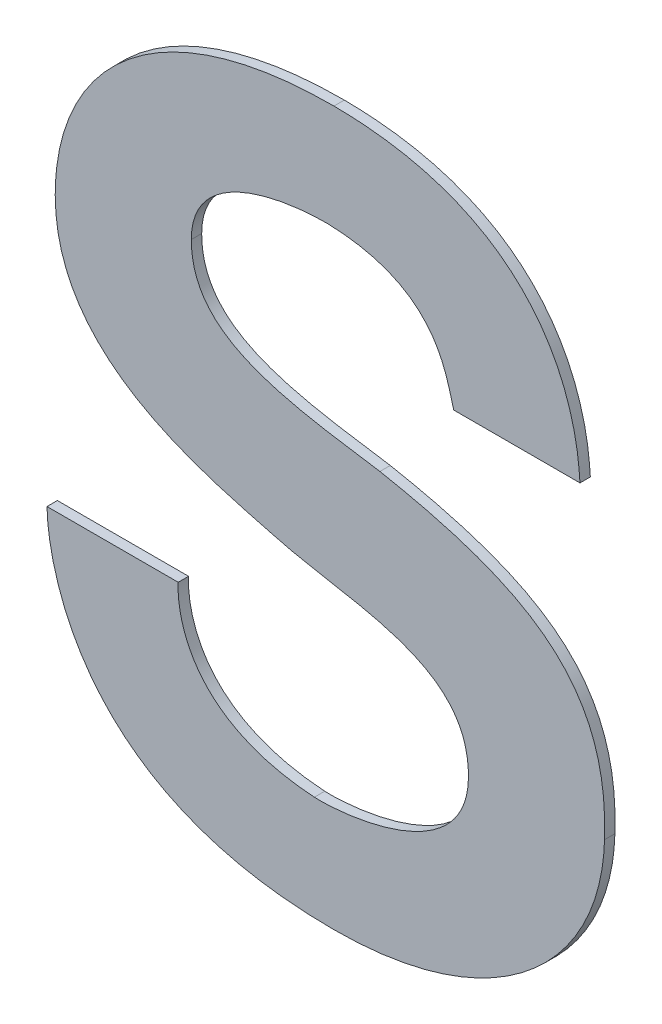
ISO-10303-21;
HEADER;
FILE_DESCRIPTION(('STEP AP214'),'2;1');
FILE_NAME('part.step','',(''),(''),'','','');
FILE_SCHEMA(('AUTOMOTIVE_DESIGN { 1 0 10303 214 1 1 1 1 }'));
ENDSEC;
DATA;
#1=APPLICATION_CONTEXT('core data for automotive mechanical design processes');
#2=APPLICATION_PROTOCOL_DEFINITION('international standard','automotive_design',2000,#1);
#3=PRODUCT_CONTEXT('',#1,'mechanical');
#4=PRODUCT('Part','Part','',(#3));
#5=PRODUCT_RELATED_PRODUCT_CATEGORY('part','',(#4));
#6=PRODUCT_DEFINITION_FORMATION('','',#4);
#7=PRODUCT_DEFINITION_CONTEXT('part definition',#1,'design');
#8=PRODUCT_DEFINITION('design','',#6,#7);
#9=PRODUCT_DEFINITION_SHAPE('','',#8);
#10=(LENGTH_UNIT() NAMED_UNIT(*) SI_UNIT(.MILLI.,.METRE.));
#11=(NAMED_UNIT(*) PLANE_ANGLE_UNIT() SI_UNIT($,.RADIAN.));
#12=(NAMED_UNIT(*) SI_UNIT($,.STERADIAN.) SOLID_ANGLE_UNIT());
#13=UNCERTAINTY_MEASURE_WITH_UNIT(LENGTH_MEASURE(1.E-05),#10,'distance_accuracy_value','');
#14=(GEOMETRIC_REPRESENTATION_CONTEXT(3) GLOBAL_UNCERTAINTY_ASSIGNED_CONTEXT((#13)) GLOBAL_UNIT_ASSIGNED_CONTEXT((#10,
#11,#12)) REPRESENTATION_CONTEXT('',''));
#15=CARTESIAN_POINT('',(0.,0.,0.));
#16=DIRECTION('',(0.,0.,1.));
#17=DIRECTION('',(1.,0.,0.));
#18=AXIS2_PLACEMENT_3D('',#15,#16,#17);
#19=CARTESIAN_POINT('',(3.8557982906351,-0.719548093305039,0.));
#20=CARTESIAN_POINT('',(3.8557982906351,-0.719548093305039,0.003));
#21=CARTESIAN_POINT('',(3.8026562629509,-0.719548093305068,0.));
#22=CARTESIAN_POINT('',(3.8026562629509,-0.719548093305068,0.003));
#23=CARTESIAN_POINT('',(3.7751379758872,-0.748502446570892,0.));
#24=CARTESIAN_POINT('',(3.7751379758872,-0.748502446570892,0.003));
#25=CARTESIAN_POINT('',(3.7751379758872,-0.782186535028101,0.));
#26=CARTESIAN_POINT('',(3.7751379758872,-0.782186535028101,0.003));
#27=B_SPLINE_SURFACE_WITH_KNOTS('',3,1,((#19,#20),(#21,#22),(#23,#24),(#25,#26)),.UNSPECIFIED.,
.F.,.F.,.F.,(4,4),(2,2),(0.,1.),(0.,0.0003),.UNSPECIFIED.);
#28=CARTESIAN_POINT('',(3.8557982906351,-0.719548093305039,0.));
#29=CARTESIAN_POINT('',(3.8026562629509,-0.719548093305068,0.));
#30=CARTESIAN_POINT('',(3.7751379758872,-0.748502446570892,0.));
#31=CARTESIAN_POINT('',(3.7751379758872,-0.782186535028101,0.));
#32=B_SPLINE_CURVE_WITH_KNOTS('',3,(#28,#29,#30,#31),.UNSPECIFIED.,.F.,.F.,(4,4),(0.,1.),.UNSPECIFIED.);
#33=CARTESIAN_POINT('',(3.8557982906351,-0.719548093305039,0.));
#34=VERTEX_POINT('',#33);
#35=CARTESIAN_POINT('',(3.7751379758872,-0.782186535028101,0.));
#36=VERTEX_POINT('',#35);
#37=EDGE_CURVE('E11',#34,#36,#32,.T.);
#38=DIRECTION('',(0.,0.,1.));
#39=VECTOR('',#38,1.);
#40=CARTESIAN_POINT('',(3.7751379758872,-0.782186535028101,0.));
#41=LINE('',#40,#39);
#42=CARTESIAN_POINT('',(3.7751379758872,-0.782186535028101,0.003));
#43=VERTEX_POINT('',#42);
#44=EDGE_CURVE('E28',#36,#43,#41,.T.);
#45=CARTESIAN_POINT('',(3.8557982906351,-0.719548093305039,0.003));
#46=CARTESIAN_POINT('',(3.8026562629509,-0.719548093305068,0.003));
#47=CARTESIAN_POINT('',(3.7751379758872,-0.748502446570892,0.003));
#48=CARTESIAN_POINT('',(3.7751379758872,-0.782186535028101,0.003));
#49=B_SPLINE_CURVE_WITH_KNOTS('',3,(#45,#46,#47,#48),.UNSPECIFIED.,.F.,.F.,(4,4),(0.,1.),.UNSPECIFIED.);
#50=CARTESIAN_POINT('',(3.8557982906351,-0.719548093305039,0.003));
#51=VERTEX_POINT('',#50);
#52=EDGE_CURVE('E140',#51,#43,#49,.T.);
#53=DIRECTION('',(0.,0.,1.));
#54=VECTOR('',#53,1.);
#55=CARTESIAN_POINT('',(3.8557982906351,-0.719548093305039,0.));
#56=LINE('',#55,#54);
#57=EDGE_CURVE('E423',#34,#51,#56,.T.);
#58=ORIENTED_EDGE('',*,*,#37,.T.);
#59=ORIENTED_EDGE('',*,*,#44,.T.);
#60=ORIENTED_EDGE('',*,*,#52,.F.);
#61=ORIENTED_EDGE('',*,*,#57,.F.);
#62=EDGE_LOOP('',(#58,#59,#60,#61));
#63=FACE_BOUND('',#62,.T.);
#64=ADVANCED_FACE('F17',(#63),#27,.T.);
#65=CARTESIAN_POINT('',(3.9269953459074,-0.778401231237702,0.));
#66=CARTESIAN_POINT('',(3.9269953459074,-0.778401231237702,0.003));
#67=CARTESIAN_POINT('',(3.926512271671,-0.775078152073892,0.));
#68=CARTESIAN_POINT('',(3.926512271671,-0.775078152073892,0.003));
#69=CARTESIAN_POINT('',(3.9269953462112,-0.720029263090209,0.));
#70=CARTESIAN_POINT('',(3.9269953462112,-0.720029263090209,0.003));
#71=CARTESIAN_POINT('',(3.8557982906351,-0.719548093305039,0.));
#72=CARTESIAN_POINT('',(3.8557982906351,-0.719548093305039,0.003));
#73=B_SPLINE_SURFACE_WITH_KNOTS('',3,1,((#65,#66),(#67,#68),(#69,#70),(#71,#72)),.UNSPECIFIED.,
.F.,.F.,.F.,(4,4),(2,2),(0.,1.),(0.,0.0003),.UNSPECIFIED.);
#74=CARTESIAN_POINT('',(3.9269953459074,-0.778401231237702,0.));
#75=CARTESIAN_POINT('',(3.926512271671,-0.775078152073892,0.));
#76=CARTESIAN_POINT('',(3.9269953462112,-0.720029263090209,0.));
#77=CARTESIAN_POINT('',(3.8557982906351,-0.719548093305039,0.));
#78=B_SPLINE_CURVE_WITH_KNOTS('',3,(#74,#75,#76,#77),.UNSPECIFIED.,.F.,.F.,(4,4),(0.,1.),.UNSPECIFIED.);
#79=CARTESIAN_POINT('',(3.9269953459074,-0.778401231237702,0.));
#80=VERTEX_POINT('',#79);
#81=EDGE_CURVE('E415',#80,#34,#78,.T.);
#82=CARTESIAN_POINT('',(3.9269953459074,-0.778401231237702,0.003));
#83=CARTESIAN_POINT('',(3.926512271671,-0.775078152073892,0.003));
#84=CARTESIAN_POINT('',(3.9269953462112,-0.720029263090209,0.003));
#85=CARTESIAN_POINT('',(3.8557982906351,-0.719548093305039,0.003));
#86=B_SPLINE_CURVE_WITH_KNOTS('',3,(#82,#83,#84,#85),.UNSPECIFIED.,.F.,.F.,(4,4),(0.,1.),.UNSPECIFIED.);
#87=CARTESIAN_POINT('',(3.9269953459074,-0.778401231237702,0.003));
#88=VERTEX_POINT('',#87);
#89=EDGE_CURVE('E411',#88,#51,#86,.T.);
#90=DIRECTION('',(0.,0.,1.));
#91=VECTOR('',#90,1.);
#92=CARTESIAN_POINT('',(3.9269953459074,-0.778401231237702,0.));
#93=LINE('',#92,#91);
#94=EDGE_CURVE('E408',#80,#88,#93,.T.);
#95=ORIENTED_EDGE('',*,*,#81,.T.);
#96=ORIENTED_EDGE('',*,*,#57,.T.);
#97=ORIENTED_EDGE('',*,*,#89,.F.);
#98=ORIENTED_EDGE('',*,*,#94,.F.);
#99=EDGE_LOOP('',(#95,#96,#97,#98));
#100=FACE_BOUND('',#99,.T.);
#101=ADVANCED_FACE('F491',(#100),#73,.T.);
#102=CARTESIAN_POINT('',(3.8904684905152,-0.778401231237702,0.));
#103=DIRECTION('',(0.,-1.,0.));
#104=DIRECTION('',(1.,0.,0.));
#105=AXIS2_PLACEMENT_3D('',#102,#103,#104);
#106=PLANE('',#105);
#107=DIRECTION('',(1.,0.,0.));
#108=VECTOR('',#107,1.);
#109=CARTESIAN_POINT('',(3.8904684905152,-0.778401231237702,0.));
#110=LINE('',#109,#108);
#111=CARTESIAN_POINT('',(3.8904684905152,-0.778401231237702,0.));
#112=VERTEX_POINT('',#111);
#113=EDGE_CURVE('E405',#112,#80,#110,.T.);
#114=ORIENTED_EDGE('',*,*,#113,.T.);
#115=ORIENTED_EDGE('',*,*,#94,.T.);
#116=DIRECTION('',(1.,0.,0.));
#117=VECTOR('',#116,1.);
#118=CARTESIAN_POINT('',(3.8904684905152,-0.778401231237702,0.003));
#119=LINE('',#118,#117);
#120=CARTESIAN_POINT('',(3.8904684905152,-0.778401231237702,0.003));
#121=VERTEX_POINT('',#120);
#122=EDGE_CURVE('E402',#121,#88,#119,.T.);
#123=ORIENTED_EDGE('',*,*,#122,.F.);
#124=DIRECTION('',(0.,0.,1.));
#125=VECTOR('',#124,1.);
#126=CARTESIAN_POINT('',(3.8904684905152,-0.778401231237702,0.));
#127=LINE('',#126,#125);
#128=EDGE_CURVE('E396',#112,#121,#127,.T.);
#129=ORIENTED_EDGE('',*,*,#128,.F.);
#130=EDGE_LOOP('',(#114,#115,#123,#129));
#131=FACE_BOUND('',#130,.T.);
#132=ADVANCED_FACE('F488',(#131),#106,.T.);
#133=CARTESIAN_POINT('',(3.8539226896577,-0.749927145494897,0.));
#134=CARTESIAN_POINT('',(3.8539226896577,-0.749927145494897,0.003));
#135=CARTESIAN_POINT('',(3.8857036783637,-0.750867792622892,0.));
#136=CARTESIAN_POINT('',(3.8857036783637,-0.750867792622892,0.003));
#137=CARTESIAN_POINT('',(3.8880624083526,-0.770312467639434,0.));
#138=CARTESIAN_POINT('',(3.8880624083526,-0.770312467639434,0.003));
#139=CARTESIAN_POINT('',(3.8904684905152,-0.778401231237702,0.));
#140=CARTESIAN_POINT('',(3.8904684905152,-0.778401231237702,0.003));
#141=B_SPLINE_SURFACE_WITH_KNOTS('',3,1,((#133,#134),(#135,#136),(#137,#138),(#139,#140)),
.UNSPECIFIED.,.F.,.F.,.F.,(4,4),(2,2),(0.,1.),(0.,0.0003),.UNSPECIFIED.);
#142=CARTESIAN_POINT('',(3.8539226896577,-0.749927145494897,0.));
#143=CARTESIAN_POINT('',(3.8857036783637,-0.750867792622892,0.));
#144=CARTESIAN_POINT('',(3.8880624083526,-0.770312467639434,0.));
#145=CARTESIAN_POINT('',(3.8904684905152,-0.778401231237702,0.));
#146=B_SPLINE_CURVE_WITH_KNOTS('',3,(#142,#143,#144,#145),.UNSPECIFIED.,.F.,.F.,(4,4),(0.,1.),.UNSPECIFIED.);
#147=CARTESIAN_POINT('',(3.8539226896577,-0.749927145494897,0.));
#148=VERTEX_POINT('',#147);
#149=EDGE_CURVE('E388',#148,#112,#146,.T.);
#150=CARTESIAN_POINT('',(3.8539226896577,-0.749927145494897,0.003));
#151=CARTESIAN_POINT('',(3.8857036783637,-0.750867792622892,0.003));
#152=CARTESIAN_POINT('',(3.8880624083526,-0.770312467639434,0.003));
#153=CARTESIAN_POINT('',(3.8904684905152,-0.778401231237702,0.003));
#154=B_SPLINE_CURVE_WITH_KNOTS('',3,(#150,#151,#152,#153),.UNSPECIFIED.,.F.,.F.,(4,4),(0.,1.),.UNSPECIFIED.);
#155=CARTESIAN_POINT('',(3.8539226896577,-0.749927145494897,0.003));
#156=VERTEX_POINT('',#155);
#157=EDGE_CURVE('E383',#156,#121,#154,.T.);
#158=DIRECTION('',(0.,0.,1.));
#159=VECTOR('',#158,1.);
#160=CARTESIAN_POINT('',(3.8539226896577,-0.749927145494897,0.));
#161=LINE('',#160,#159);
#162=EDGE_CURVE('E377',#148,#156,#161,.T.);
#163=ORIENTED_EDGE('',*,*,#149,.T.);
#164=ORIENTED_EDGE('',*,*,#128,.T.);
#165=ORIENTED_EDGE('',*,*,#157,.F.);
#166=ORIENTED_EDGE('',*,*,#162,.F.);
#167=EDGE_LOOP('',(#163,#164,#165,#166));
#168=FACE_BOUND('',#167,.T.);
#169=ADVANCED_FACE('F485',(#168),#141,.T.);
#170=CARTESIAN_POINT('',(3.8145255964063,-0.773635499663952,0.));
#171=CARTESIAN_POINT('',(3.8145255964063,-0.773635499663952,0.003));
#172=CARTESIAN_POINT('',(3.814525597177,-0.755152310392204,0.));
#173=CARTESIAN_POINT('',(3.814525597177,-0.755152310392204,0.003));
#174=CARTESIAN_POINT('',(3.838264263319,-0.74992714780477,0.));
#175=CARTESIAN_POINT('',(3.838264263319,-0.74992714780477,0.003));
#176=CARTESIAN_POINT('',(3.8539226896577,-0.749927145494897,0.));
#177=CARTESIAN_POINT('',(3.8539226896577,-0.749927145494897,0.003));
#178=B_SPLINE_SURFACE_WITH_KNOTS('',3,1,((#170,#171),(#172,#173),(#174,#175),(#176,#177)),
.UNSPECIFIED.,.F.,.F.,.F.,(4,4),(2,2),(0.,1.),(0.,0.0003),.UNSPECIFIED.);
#179=CARTESIAN_POINT('',(3.8145255964063,-0.773635499663952,0.));
#180=CARTESIAN_POINT('',(3.814525597177,-0.755152310392204,0.));
#181=CARTESIAN_POINT('',(3.838264263319,-0.74992714780477,0.));
#182=CARTESIAN_POINT('',(3.8539226896577,-0.749927145494897,0.));
#183=B_SPLINE_CURVE_WITH_KNOTS('',3,(#179,#180,#181,#182),.UNSPECIFIED.,.F.,.F.,(4,4),(0.,1.),.UNSPECIFIED.);
#184=CARTESIAN_POINT('',(3.8145255964063,-0.773635499663952,0.));
#185=VERTEX_POINT('',#184);
#186=EDGE_CURVE('E369',#185,#148,#183,.T.);
#187=CARTESIAN_POINT('',(3.8145255964063,-0.773635499663952,0.003));
#188=CARTESIAN_POINT('',(3.814525597177,-0.755152310392204,0.003));
#189=CARTESIAN_POINT('',(3.838264263319,-0.74992714780477,0.003));
#190=CARTESIAN_POINT('',(3.8539226896577,-0.749927145494897,0.003));
#191=B_SPLINE_CURVE_WITH_KNOTS('',3,(#187,#188,#189,#190),.UNSPECIFIED.,.F.,.F.,(4,4),(0.,1.),.UNSPECIFIED.);
#192=CARTESIAN_POINT('',(3.8145255964063,-0.773635499663952,0.003));
#193=VERTEX_POINT('',#192);
#194=EDGE_CURVE('E364',#193,#156,#191,.T.);
#195=DIRECTION('',(0.,0.,1.));
#196=VECTOR('',#195,1.);
#197=CARTESIAN_POINT('',(3.8145255964063,-0.773635499663952,0.));
#198=LINE('',#197,#196);
#199=EDGE_CURVE('E358',#185,#193,#198,.T.);
#200=ORIENTED_EDGE('',*,*,#186,.T.);
#201=ORIENTED_EDGE('',*,*,#162,.T.);
#202=ORIENTED_EDGE('',*,*,#194,.F.);
#203=ORIENTED_EDGE('',*,*,#199,.F.);
#204=EDGE_LOOP('',(#200,#201,#202,#203));
#205=FACE_BOUND('',#204,.T.);
#206=ADVANCED_FACE('F482',(#205),#178,.T.);
#207=CARTESIAN_POINT('',(3.8690980066546,-0.804473032093063,0.));
#208=CARTESIAN_POINT('',(3.8690980066546,-0.804473032093063,0.003));
#209=CARTESIAN_POINT('',(3.8410871419968,-0.800210298121506,0.));
#210=CARTESIAN_POINT('',(3.8410871419968,-0.800210298121506,0.003));
#211=CARTESIAN_POINT('',(3.8145256003293,-0.796906213605293,0.));
#212=CARTESIAN_POINT('',(3.8145256003293,-0.796906213605293,0.003));
#213=CARTESIAN_POINT('',(3.8145255964063,-0.773635499663952,0.));
#214=CARTESIAN_POINT('',(3.8145255964063,-0.773635499663952,0.003));
#215=B_SPLINE_SURFACE_WITH_KNOTS('',3,1,((#207,#208),(#209,#210),(#211,#212),(#213,#214)),
.UNSPECIFIED.,.F.,.F.,.F.,(4,4),(2,2),(0.,1.),(0.,0.0003),.UNSPECIFIED.);
#216=CARTESIAN_POINT('',(3.8690980066546,-0.804473032093063,0.));
#217=CARTESIAN_POINT('',(3.8410871419968,-0.800210298121506,0.));
#218=CARTESIAN_POINT('',(3.8145256003293,-0.796906213605293,0.));
#219=CARTESIAN_POINT('',(3.8145255964063,-0.773635499663952,0.));
#220=B_SPLINE_CURVE_WITH_KNOTS('',3,(#216,#217,#218,#219),.UNSPECIFIED.,.F.,.F.,(4,4),(0.,1.),.UNSPECIFIED.);
#221=CARTESIAN_POINT('',(3.8690980066546,-0.804473032093063,0.));
#222=VERTEX_POINT('',#221);
#223=EDGE_CURVE('E350',#222,#185,#220,.T.);
#224=CARTESIAN_POINT('',(3.8690980066546,-0.804473032093063,0.003));
#225=CARTESIAN_POINT('',(3.8410871419968,-0.800210298121506,0.003));
#226=CARTESIAN_POINT('',(3.8145256003293,-0.796906213605293,0.003));
#227=CARTESIAN_POINT('',(3.8145255964063,-0.773635499663952,0.003));
#228=B_SPLINE_CURVE_WITH_KNOTS('',3,(#224,#225,#226,#227),.UNSPECIFIED.,.F.,.F.,(4,4),(0.,1.),.UNSPECIFIED.);
#229=CARTESIAN_POINT('',(3.8690980066546,-0.804473032093063,0.003));
#230=VERTEX_POINT('',#229);
#231=EDGE_CURVE('E345',#230,#193,#228,.T.);
#232=DIRECTION('',(0.,0.,1.));
#233=VECTOR('',#232,1.);
#234=CARTESIAN_POINT('',(3.8690980066546,-0.804473032093063,0.));
#235=LINE('',#234,#233);
#236=EDGE_CURVE('E339',#222,#230,#235,.T.);
#237=ORIENTED_EDGE('',*,*,#223,.T.);
#238=ORIENTED_EDGE('',*,*,#199,.T.);
#239=ORIENTED_EDGE('',*,*,#231,.F.);
#240=ORIENTED_EDGE('',*,*,#236,.F.);
#241=EDGE_LOOP('',(#237,#238,#239,#240));
#242=FACE_BOUND('',#241,.T.);
#243=ADVANCED_FACE('F479',(#242),#215,.T.);
#244=CARTESIAN_POINT('',(3.9340998950631,-0.864269654153528,0.));
#245=CARTESIAN_POINT('',(3.9340998950631,-0.864269654153528,0.003));
#246=CARTESIAN_POINT('',(3.9355397503589,-0.825384088440838,0.));
#247=CARTESIAN_POINT('',(3.9355397503589,-0.825384088440838,0.003));
#248=CARTESIAN_POINT('',(3.9113369195682,-0.812565587217635,0.));
#249=CARTESIAN_POINT('',(3.9113369195682,-0.812565587217635,0.003));
#250=CARTESIAN_POINT('',(3.8690980066546,-0.804473032093063,0.));
#251=CARTESIAN_POINT('',(3.8690980066546,-0.804473032093063,0.003));
#252=B_SPLINE_SURFACE_WITH_KNOTS('',3,1,((#244,#245),(#246,#247),(#248,#249),(#250,#251)),
.UNSPECIFIED.,.F.,.F.,.F.,(4,4),(2,2),(0.,1.),(0.,0.0003),.UNSPECIFIED.);
#253=CARTESIAN_POINT('',(3.9340998950631,-0.864269654153528,0.));
#254=CARTESIAN_POINT('',(3.9355397503589,-0.825384088440838,0.));
#255=CARTESIAN_POINT('',(3.9113369195682,-0.812565587217635,0.));
#256=CARTESIAN_POINT('',(3.8690980066546,-0.804473032093063,0.));
#257=B_SPLINE_CURVE_WITH_KNOTS('',3,(#253,#254,#255,#256),.UNSPECIFIED.,.F.,.F.,(4,4),(0.,1.),.UNSPECIFIED.);
#258=CARTESIAN_POINT('',(3.9340998950631,-0.864269654153528,0.));
#259=VERTEX_POINT('',#258);
#260=EDGE_CURVE('E331',#259,#222,#257,.T.);
#261=CARTESIAN_POINT('',(3.9340998950631,-0.864269654153528,0.003));
#262=CARTESIAN_POINT('',(3.9355397503589,-0.825384088440838,0.003));
#263=CARTESIAN_POINT('',(3.9113369195682,-0.812565587217635,0.003));
#264=CARTESIAN_POINT('',(3.8690980066546,-0.804473032093063,0.003));
#265=B_SPLINE_CURVE_WITH_KNOTS('',3,(#261,#262,#263,#264),.UNSPECIFIED.,.F.,.F.,(4,4),(0.,1.),.UNSPECIFIED.);
#266=CARTESIAN_POINT('',(3.9340998950631,-0.864269654153528,0.003));
#267=VERTEX_POINT('',#266);
#268=EDGE_CURVE('E326',#267,#230,#265,.T.);
#269=DIRECTION('',(0.,0.,1.));
#270=VECTOR('',#269,1.);
#271=CARTESIAN_POINT('',(3.9340998950631,-0.864269654153528,0.));
#272=LINE('',#271,#270);
#273=EDGE_CURVE('E323',#259,#267,#272,.T.);
#274=ORIENTED_EDGE('',*,*,#260,.T.);
#275=ORIENTED_EDGE('',*,*,#236,.T.);
#276=ORIENTED_EDGE('',*,*,#268,.F.);
#277=ORIENTED_EDGE('',*,*,#273,.F.);
#278=EDGE_LOOP('',(#274,#275,#276,#277));
#279=FACE_BOUND('',#278,.T.);
#280=ADVANCED_FACE('F476',(#279),#252,.T.);
#281=CARTESIAN_POINT('',(3.8557982906351,-0.925968400841521,0.));
#282=CARTESIAN_POINT('',(3.8557982906351,-0.925968400841521,0.003));
#283=CARTESIAN_POINT('',(3.9027830984676,-0.925968429307479,0.));
#284=CARTESIAN_POINT('',(3.9027830984676,-0.925968429307479,0.003));
#285=CARTESIAN_POINT('',(3.9331621256302,-0.89843495825902,0.));
#286=CARTESIAN_POINT('',(3.9331621256302,-0.89843495825902,0.003));
#287=CARTESIAN_POINT('',(3.9340998950631,-0.864269654153528,0.));
#288=CARTESIAN_POINT('',(3.9340998950631,-0.864269654153528,0.003));
#289=B_SPLINE_SURFACE_WITH_KNOTS('',3,1,((#281,#282),(#283,#284),(#285,#286),(#287,#288)),
.UNSPECIFIED.,.F.,.F.,.F.,(4,4),(2,2),(0.,1.),(0.,0.0003),.UNSPECIFIED.);
#290=CARTESIAN_POINT('',(3.8557982906351,-0.925968400841521,0.));
#291=CARTESIAN_POINT('',(3.9027830984676,-0.925968429307479,0.));
#292=CARTESIAN_POINT('',(3.9331621256302,-0.89843495825902,0.));
#293=CARTESIAN_POINT('',(3.9340998950631,-0.864269654153528,0.));
#294=B_SPLINE_CURVE_WITH_KNOTS('',3,(#290,#291,#292,#293),.UNSPECIFIED.,.F.,.F.,(4,4),(0.,1.),.UNSPECIFIED.);
#295=CARTESIAN_POINT('',(3.8557982906351,-0.925968400841521,0.));
#296=VERTEX_POINT('',#295);
#297=EDGE_CURVE('E313',#296,#259,#294,.T.);
#298=CARTESIAN_POINT('',(3.8557982906351,-0.925968400841521,0.003));
#299=CARTESIAN_POINT('',(3.9027830984676,-0.925968429307479,0.003));
#300=CARTESIAN_POINT('',(3.9331621256302,-0.89843495825902,0.003));
#301=CARTESIAN_POINT('',(3.9340998950631,-0.864269654153528,0.003));
#302=B_SPLINE_CURVE_WITH_KNOTS('',3,(#298,#299,#300,#301),.UNSPECIFIED.,.F.,.F.,(4,4),(0.,1.),.UNSPECIFIED.);
#303=CARTESIAN_POINT('',(3.8557982906351,-0.925968400841521,0.003));
#304=VERTEX_POINT('',#303);
#305=EDGE_CURVE('E303',#304,#267,#302,.T.);
#306=DIRECTION('',(0.,0.,1.));
#307=VECTOR('',#306,1.);
#308=CARTESIAN_POINT('',(3.8557982906351,-0.925968400841521,0.));
#309=LINE('',#308,#307);
#310=EDGE_CURVE('E301',#296,#304,#309,.T.);
#311=ORIENTED_EDGE('',*,*,#297,.T.);
#312=ORIENTED_EDGE('',*,*,#273,.T.);
#313=ORIENTED_EDGE('',*,*,#305,.F.);
#314=ORIENTED_EDGE('',*,*,#310,.F.);
#315=EDGE_LOOP('',(#311,#312,#313,#314));
#316=FACE_BOUND('',#315,.T.);
#317=ADVANCED_FACE('F272',(#316),#289,.T.);
#318=CARTESIAN_POINT('',(3.7727603201028,-0.861427834491345,0.));
#319=CARTESIAN_POINT('',(3.7727603201028,-0.861427834491345,0.003));
#320=CARTESIAN_POINT('',(3.7727598352929,-0.861454182853754,0.));
#321=CARTESIAN_POINT('',(3.7727598352929,-0.861454182853754,0.003));
#322=CARTESIAN_POINT('',(3.7718130468821,-0.925968530995148,0.));
#323=CARTESIAN_POINT('',(3.7718130468821,-0.925968530995148,0.003));
#324=CARTESIAN_POINT('',(3.8557982906351,-0.925968400841521,0.));
#325=CARTESIAN_POINT('',(3.8557982906351,-0.925968400841521,0.003));
#326=B_SPLINE_SURFACE_WITH_KNOTS('',3,1,((#318,#319),(#320,#321),(#322,#323),(#324,#325)),
.UNSPECIFIED.,.F.,.F.,.F.,(4,4),(2,2),(0.,1.),(0.,0.0003),.UNSPECIFIED.);
#327=CARTESIAN_POINT('',(3.7727603201028,-0.861427834491345,0.));
#328=CARTESIAN_POINT('',(3.7727598352929,-0.861454182853754,0.));
#329=CARTESIAN_POINT('',(3.7718130468821,-0.925968530995148,0.));
#330=CARTESIAN_POINT('',(3.8557982906351,-0.925968400841521,0.));
#331=B_SPLINE_CURVE_WITH_KNOTS('',3,(#327,#328,#329,#330),.UNSPECIFIED.,.F.,.F.,(4,4),(0.,1.),.UNSPECIFIED.);
#332=CARTESIAN_POINT('',(3.7727603201028,-0.861427834491345,0.));
#333=VERTEX_POINT('',#332);
#334=EDGE_CURVE('E298',#333,#296,#331,.T.);
#335=CARTESIAN_POINT('',(3.8557982906351,-0.925968400841521,0.003));
#336=CARTESIAN_POINT('',(3.85325423236502,-0.925968022084498,0.003));
#337=CARTESIAN_POINT('',(3.85070933367878,-0.925909183452784,0.003));
#338=CARTESIAN_POINT('',(3.84578095483742,-0.925664864982023,0.003));
#339=CARTESIAN_POINT('',(3.84339707058699,-0.925487304762054,0.003));
#340=CARTESIAN_POINT('',(3.83878515445427,-0.925013968522742,0.003));
#341=CARTESIAN_POINT('',(3.8365563588247,-0.924725930462439,0.003));
#342=CARTESIAN_POINT('',(3.83327867944572,-0.924203545866295,0.003));
#343=CARTESIAN_POINT('',(3.83222159154248,-0.924019743962702,0.003));
#344=CARTESIAN_POINT('',(3.83014446561794,-0.923626573497493,0.003));
#345=CARTESIAN_POINT('',(3.82912425554253,-0.923418120522816,0.003));
#346=CARTESIAN_POINT('',(3.82712028793692,-0.922976661732953,0.003));
#347=CARTESIAN_POINT('',(3.82613633414177,-0.922744547852797,0.003));
#348=CARTESIAN_POINT('',(3.82420423779819,-0.922256776248891,0.003));
#349=CARTESIAN_POINT('',(3.8232558771957,-0.922001984093891,0.003));
#350=CARTESIAN_POINT('',(3.821394335632,-0.921469869927963,0.003));
#351=CARTESIAN_POINT('',(3.82048091598287,-0.921193384271723,0.003));
#352=CARTESIAN_POINT('',(3.81868862031097,-0.92061889936277,0.003));
#353=CARTESIAN_POINT('',(3.81780948677202,-0.920321704689423,0.003));
#354=CARTESIAN_POINT('',(3.81608512617349,-0.919706820684976,0.003));
#355=CARTESIAN_POINT('',(3.81523962471023,-0.919389901856867,0.003));
#356=CARTESIAN_POINT('',(3.81358188884251,-0.918736590684973,0.003));
#357=CARTESIAN_POINT('',(3.81276936530744,-0.918400932808981,0.003));
#358=CARTESIAN_POINT('',(3.81117694364445,-0.917711166561225,0.003));
#359=CARTESIAN_POINT('',(3.81039674396017,-0.917357755051958,0.003));
#360=CARTESIAN_POINT('',(3.80886832591788,-0.916633506004873,0.003));
#361=CARTESIAN_POINT('',(3.80811979597063,-0.916263326586144,0.003));
#362=CARTESIAN_POINT('',(3.80665407083026,-0.915506567178773,0.003));
#363=CARTESIAN_POINT('',(3.80593655643477,-0.915120605887991,0.003));
#364=CARTESIAN_POINT('',(3.80453221331935,-0.914333308702355,0.003));
#365=CARTESIAN_POINT('',(3.80384506016524,-0.913932551880109,0.003));
#366=CARTESIAN_POINT('',(3.802500788006,-0.91311668961301,0.003));
#367=CARTESIAN_POINT('',(3.80184334161206,-0.912702123882166,0.003));
#368=CARTESIAN_POINT('',(3.80055782912301,-0.911859669312288,0.003));
#369=CARTESIAN_POINT('',(3.79992943479589,-0.911432281546223,0.003));
#370=CARTESIAN_POINT('',(3.79870137045368,-0.91056520749699,0.003));
#371=CARTESIAN_POINT('',(3.79810137325478,-0.910125984778709,0.003));
#372=CARTESIAN_POINT('',(3.79692944528614,-0.909236264078797,0.003));
#373=CARTESIAN_POINT('',(3.79635719000817,-0.908786193653105,0.003));
#374=CARTESIAN_POINT('',(3.79524008638514,-0.907875799095952,0.003));
#375=CARTESIAN_POINT('',(3.7946949175392,-0.907415868316767,0.003));
#376=CARTESIAN_POINT('',(3.79363132598296,-0.906486772622364,0.003));
#377=CARTESIAN_POINT('',(3.7931125877976,-0.906017968899881,0.003));
#378=CARTESIAN_POINT('',(3.79210119578812,-0.905072144675416,0.003));
#379=CARTESIAN_POINT('',(3.79160823221629,-0.904595455418975,0.003));
#380=CARTESIAN_POINT('',(3.79064772701628,-0.903634875138655,0.003));
#381=CARTESIAN_POINT('',(3.79017988176161,-0.903151287722976,0.003));
#382=CARTESIAN_POINT('',(3.78926895041985,-0.902177923660029,0.003));
#383=CARTESIAN_POINT('',(3.78882556693571,-0.901688425325827,0.003));
#384=CARTESIAN_POINT('',(3.78796289639052,-0.900704249684828,0.003));
#385=CARTESIAN_POINT('',(3.7875433180128,-0.90020982770584,0.003));
#386=CARTESIAN_POINT('',(3.78672759485095,-0.899216812057981,0.003));
#387=CARTESIAN_POINT('',(3.78633116447028,-0.898718452975431,0.003));
#388=CARTESIAN_POINT('',(3.78556107594867,-0.897718570256162,0.003));
#389=CARTESIAN_POINT('',(3.78518713737083,-0.897217262538499,0.003));
#390=CARTESIAN_POINT('',(3.78446136785628,-0.896212479769446,0.003));
#391=CARTESIAN_POINT('',(3.78410926103595,-0.895709204069347,0.003));
#392=CARTESIAN_POINT('',(3.78342650508581,-0.894701508800733,0.003));
#393=CARTESIAN_POINT('',(3.78309558361063,-0.894197273299538,0.003));
#394=CARTESIAN_POINT('',(3.78214288560281,-0.892698279604937,0.003));
#395=CARTESIAN_POINT('',(3.78154177409275,-0.891690275004185,0.003));
#396=CARTESIAN_POINT('',(3.78041861133561,-0.889681116655772,0.003));
#397=CARTESIAN_POINT('',(3.77989442758137,-0.888681150267366,0.003));
#398=CARTESIAN_POINT('',(3.77891977802082,-0.886696026178137,0.003));
#399=CARTESIAN_POINT('',(3.77846718471204,-0.885711912564393,0.003));
#400=CARTESIAN_POINT('',(3.77763047336567,-0.883766521345258,0.003));
#401=CARTESIAN_POINT('',(3.7772442092494,-0.882806165311103,0.003));
#402=CARTESIAN_POINT('',(3.77653491593099,-0.880916268806863,0.003));
#403=CARTESIAN_POINT('',(3.7762097072517,-0.879987545316753,0.003));
#404=CARTESIAN_POINT('',(3.77561730545157,-0.878168885457548,0.003));
#405=CARTESIAN_POINT('',(3.77534788900867,-0.877279672414474,0.003));
#406=CARTESIAN_POINT('',(3.7748618591584,-0.875547994111038,0.003));
#407=CARTESIAN_POINT('',(3.77464297351438,-0.874706165998672,0.003));
#408=CARTESIAN_POINT('',(3.77425280561909,-0.873077213485238,0.003));
#409=CARTESIAN_POINT('',(3.77407920061869,-0.87229064497237,0.003));
#410=CARTESIAN_POINT('',(3.77377437094233,-0.870780162473227,0.003));
#411=CARTESIAN_POINT('',(3.77364077720243,-0.870056726844835,0.003));
#412=CARTESIAN_POINT('',(3.7734108251195,-0.868680463701601,0.003));
#413=CARTESIAN_POINT('',(3.77331204870374,-0.868028039471472,0.003));
#414=CARTESIAN_POINT('',(3.77314632524421,-0.866801734651693,0.003));
#415=CARTESIAN_POINT('',(3.77307694661686,-0.866228186794536,0.003));
#416=CARTESIAN_POINT('',(3.77296539780327,-0.865167618557124,0.003));
#417=CARTESIAN_POINT('',(3.77292068412931,-0.864680856316672,0.003));
#418=CARTESIAN_POINT('',(3.77282875756775,-0.863512743449046,0.003));
#419=CARTESIAN_POINT('',(3.77278759377169,-0.862830824473404,0.003));
#420=CARTESIAN_POINT('',(3.77276362012303,-0.861908206820103,0.003));
#421=CARTESIAN_POINT('',(3.7727602807311,-0.861668028837658,0.003));
#422=CARTESIAN_POINT('',(3.77276032069692,-0.861427802202425,0.003));
#423=B_SPLINE_CURVE_WITH_KNOTS('',3,(#335,#336,#337,#338,#339,#340,#341,#342,#343,#344,#345,
#346,#347,#348,#349,#350,#351,#352,#353,#354,#355,#356,#357,#358,#359,#360,#361,#362,#363,#364,
#365,#366,#367,#368,#369,#370,#371,#372,#373,#374,#375,#376,#377,#378,#379,#380,#381,#382,#383,
#384,#385,#386,#387,#388,#389,#390,#391,#392,#393,#394,#395,#396,#397,#398,#399,#400,#401,#402,
#403,#404,#405,#406,#407,#408,#409,#410,#411,#412,#413,#414,#415,#416,#417,#418,#419,#420,#421,
#422),.UNSPECIFIED.,.F.,.F.,(4,2,2,2,2,2,2,2,2,2,2,2,2,2,2,2,2,2,2,2,2,2,2,2,2,2,2,2,2,2,2,2,2,
2,2,2,2,2,2,2,2,2,2,4),(0.,0.00763267662513093,0.014801153682051,0.02153922442987,
0.0247576815611932,0.0278810689864323,0.0309134868968042,0.0338589837879182,0.0367215460745251,
0.039505086978627,0.0422134347821774,0.0448503205645611,0.0474193655732758,0.0499240684022136,
0.0523677921737557,0.0547537519369252,0.0570850025025041,0.0593644269362848,0.0615947259228199,
0.0637784081943456,0.0659177821935641,0.0680149491061472,0.0700717973609335,0.0720899986550429,
0.0740710055197913,0.076016050403598,0.0779261462118956,0.079802088212987,0.0816444571937865,
0.0834536237309783,0.0869724629274412,0.090357983723837,0.0936062046906152,0.0967104339532341,
0.0996615250600757,0.102448130328503,0.105056943155839,0.107472923847692,0.109679505993695,
0.111658782273739,0.113391669866405,0.114858056458777,0.116906331959037,0.117626904150427),.UNSPECIFIED.);
#424=CARTESIAN_POINT('',(3.7727603201028,-0.861427834491345,0.003));
#425=VERTEX_POINT('',#424);
#426=EDGE_CURVE('E256',#425,#304,#423,.F.);
#427=DIRECTION('',(0.,0.,1.));
#428=VECTOR('',#427,1.);
#429=CARTESIAN_POINT('',(3.7727603201028,-0.861427834491345,0.));
#430=LINE('',#429,#428);
#431=EDGE_CURVE('E251',#333,#425,#430,.T.);
#432=ORIENTED_EDGE('',*,*,#334,.T.);
#433=ORIENTED_EDGE('',*,*,#310,.T.);
#434=ORIENTED_EDGE('',*,*,#426,.F.);
#435=ORIENTED_EDGE('',*,*,#431,.F.);
#436=EDGE_LOOP('',(#432,#433,#434,#435));
#437=FACE_BOUND('',#436,.T.);
#438=ADVANCED_FACE('F261',(#437),#326,.T.);
#439=CARTESIAN_POINT('',(3.8107270307911,-0.861427834491345,0.));
#440=DIRECTION('',(0.,1.,0.));
#441=DIRECTION('',(-1.,0.,0.));
#442=AXIS2_PLACEMENT_3D('',#439,#440,#441);
#443=PLANE('',#442);
#444=DIRECTION('',(-1.,0.,0.));
#445=VECTOR('',#444,1.);
#446=CARTESIAN_POINT('',(3.8107270307911,-0.861427834491345,0.));
#447=LINE('',#446,#445);
#448=CARTESIAN_POINT('',(3.8107270307911,-0.861427834491345,0.));
#449=VERTEX_POINT('',#448);
#450=EDGE_CURVE('E246',#449,#333,#447,.T.);
#451=ORIENTED_EDGE('',*,*,#450,.T.);
#452=ORIENTED_EDGE('',*,*,#431,.T.);
#453=DIRECTION('',(-1.,0.,0.));
#454=VECTOR('',#453,1.);
#455=CARTESIAN_POINT('',(3.8107270307911,-0.861427834491345,0.003));
#456=LINE('',#455,#454);
#457=CARTESIAN_POINT('',(3.8107270307911,-0.861427834491345,0.003));
#458=VERTEX_POINT('',#457);
#459=EDGE_CURVE('E241',#458,#425,#456,.T.);
#460=ORIENTED_EDGE('',*,*,#459,.F.);
#461=DIRECTION('',(0.,0.,1.));
#462=VECTOR('',#461,1.);
#463=CARTESIAN_POINT('',(3.8107270307911,-0.861427834491345,0.));
#464=LINE('',#463,#462);
#465=EDGE_CURVE('E239',#449,#458,#464,.T.);
#466=ORIENTED_EDGE('',*,*,#465,.F.);
#467=EDGE_LOOP('',(#451,#452,#460,#466));
#468=FACE_BOUND('',#467,.T.);
#469=ADVANCED_FACE('F209',(#468),#443,.T.);
#470=CARTESIAN_POINT('',(3.8501335967748,-0.895593137744452,0.));
#471=CARTESIAN_POINT('',(3.8501335967748,-0.895593137744452,0.003));
#472=CARTESIAN_POINT('',(3.8078663109341,-0.892747533124338,0.));
#473=CARTESIAN_POINT('',(3.8078663109341,-0.892747533124338,0.003));
#474=CARTESIAN_POINT('',(3.8107246455752,-0.861453948285558,0.));
#475=CARTESIAN_POINT('',(3.8107246455752,-0.861453948285558,0.003));
#476=CARTESIAN_POINT('',(3.8107270307911,-0.861427834491345,0.));
#477=CARTESIAN_POINT('',(3.8107270307911,-0.861427834491345,0.003));
#478=B_SPLINE_SURFACE_WITH_KNOTS('',3,1,((#470,#471),(#472,#473),(#474,#475),(#476,#477)),
.UNSPECIFIED.,.F.,.F.,.F.,(4,4),(2,2),(0.,1.),(0.,0.0003),.UNSPECIFIED.);
#479=CARTESIAN_POINT('',(3.8501335967748,-0.895593137744452,0.));
#480=CARTESIAN_POINT('',(3.8078663109341,-0.892747533124338,0.));
#481=CARTESIAN_POINT('',(3.8107246455752,-0.861453948285558,0.));
#482=CARTESIAN_POINT('',(3.8107270307911,-0.861427834491345,0.));
#483=B_SPLINE_CURVE_WITH_KNOTS('',3,(#479,#480,#481,#482),.UNSPECIFIED.,.F.,.F.,(4,4),(0.,1.),.UNSPECIFIED.);
#484=CARTESIAN_POINT('',(3.8501335967748,-0.895593137744452,0.));
#485=VERTEX_POINT('',#484);
#486=EDGE_CURVE('E236',#485,#449,#483,.T.);
#487=CARTESIAN_POINT('',(3.81072703676393,-0.861427769099638,0.003));
#488=CARTESIAN_POINT('',(3.81071816454944,-0.861543729317613,0.003));
#489=CARTESIAN_POINT('',(3.81071097579022,-0.861659792945687,0.003));
#490=CARTESIAN_POINT('',(3.81068884165076,-0.862107454444857,0.003));
#491=CARTESIAN_POINT('',(3.81068423742767,-0.862439570206935,0.003));
#492=CARTESIAN_POINT('',(3.81068710758885,-0.863009375967869,0.003));
#493=CARTESIAN_POINT('',(3.81069152637744,-0.863247129263508,0.003));
#494=CARTESIAN_POINT('',(3.81070825825106,-0.863765707738008,0.003));
#495=CARTESIAN_POINT('',(3.81072186180281,-0.864046496156526,0.003));
#496=CARTESIAN_POINT('',(3.81075969462992,-0.864647500973221,0.003));
#497=CARTESIAN_POINT('',(3.81078516129571,-0.864967637333064,0.003));
#498=CARTESIAN_POINT('',(3.81084974557027,-0.865643737691156,0.003));
#499=CARTESIAN_POINT('',(3.81089009703596,-0.865999584202982,0.003));
#500=CARTESIAN_POINT('',(3.81098738078829,-0.866743492569157,0.003));
#501=CARTESIAN_POINT('',(3.81104552601548,-0.867131395660336,0.003));
#502=CARTESIAN_POINT('',(3.81118136312005,-0.867935811765114,0.003));
#503=CARTESIAN_POINT('',(3.81126024891817,-0.868352123391927,0.003));
#504=CARTESIAN_POINT('',(3.81144052489668,-0.86920975192778,0.003));
#505=CARTESIAN_POINT('',(3.81154308858923,-0.869650822451422,0.003));
#506=CARTESIAN_POINT('',(3.81177368215812,-0.870554367385243,0.003));
#507=CARTESIAN_POINT('',(3.81190286685713,-0.871016547503176,0.003));
#508=CARTESIAN_POINT('',(3.81218966163799,-0.871958712599424,0.003));
#509=CARTESIAN_POINT('',(3.81234841152338,-0.872438351096502,0.003));
#510=CARTESIAN_POINT('',(3.81269729458534,-0.873411841537194,0.003));
#511=CARTESIAN_POINT('',(3.81288855909714,-0.873905288722792,0.003));
#512=CARTESIAN_POINT('',(3.81330541478665,-0.874902799105807,0.003));
#513=CARTESIAN_POINT('',(3.813532137721,-0.875406389520582,0.003));
#514=CARTESIAN_POINT('',(3.81402287625533,-0.876420647664189,0.003));
#515=CARTESIAN_POINT('',(3.81428803725615,-0.876930763543775,0.003));
#516=CARTESIAN_POINT('',(3.81471174854431,-0.877691061506273,0.003));
#517=CARTESIAN_POINT('',(3.81485959709925,-0.877947264205348,0.003));
#518=CARTESIAN_POINT('',(3.81516584823672,-0.87846001300877,0.003));
#519=CARTESIAN_POINT('',(3.81532439924,-0.878716470700602,0.003));
#520=CARTESIAN_POINT('',(3.81565241537822,-0.879229268843862,0.003));
#521=CARTESIAN_POINT('',(3.81582203155246,-0.87948551263533,0.003));
#522=CARTESIAN_POINT('',(3.81617254376369,-0.87999743769044,0.003));
#523=CARTESIAN_POINT('',(3.81635359396902,-0.880253013424535,0.003));
#524=CARTESIAN_POINT('',(3.81672733791896,-0.880763153962592,0.003));
#525=CARTESIAN_POINT('',(3.81692018926396,-0.88101760330653,0.003));
#526=CARTESIAN_POINT('',(3.81731789930318,-0.881525044733583,0.003));
#527=CARTESIAN_POINT('',(3.81752291929599,-0.88177791040145,0.003));
#528=CARTESIAN_POINT('',(3.8179453300688,-0.882281738864821,0.003));
#529=CARTESIAN_POINT('',(3.81816288600045,-0.882532563191495,0.003));
#530=CARTESIAN_POINT('',(3.81861073198131,-0.883031864507883,0.003));
#531=CARTESIAN_POINT('',(3.81884119107377,-0.883280189861269,0.003));
#532=CARTESIAN_POINT('',(3.81931520667637,-0.883774049821904,0.003));
#533=CARTESIAN_POINT('',(3.81955893602253,-0.884019418513026,0.003));
#534=CARTESIAN_POINT('',(3.82005985555306,-0.884506922813132,0.003));
#535=CARTESIAN_POINT('',(3.82031722211836,-0.884748877148831,0.003));
#536=CARTESIAN_POINT('',(3.82084577977471,-0.885229111424605,0.003));
#537=CARTESIAN_POINT('',(3.82111715038708,-0.885467193723865,0.003));
#538=CARTESIAN_POINT('',(3.82167408024927,-0.88593924356299,0.003));
#539=CARTESIAN_POINT('',(3.82195982159847,-0.886172996184893,0.003));
#540=CARTESIAN_POINT('',(3.82254585762594,-0.886635947146767,0.003));
#541=CARTESIAN_POINT('',(3.82284633626705,-0.886864912515214,0.003));
#542=CARTESIAN_POINT('',(3.82346221229878,-0.887317850149879,0.003));
#543=CARTESIAN_POINT('',(3.82377779466121,-0.887541570777476,0.003));
#544=CARTESIAN_POINT('',(3.82442424442004,-0.887983580645235,0.003));
#545=CARTESIAN_POINT('',(3.82475529682153,-0.88820159915412,0.003));
#546=CARTESIAN_POINT('',(3.82543305392159,-0.88863176684399,0.003));
#547=CARTESIAN_POINT('',(3.82577994258569,-0.888843625982534,0.003));
#548=CARTESIAN_POINT('',(3.82648974054454,-0.889261037129716,0.003));
#549=CARTESIAN_POINT('',(3.8268528316235,-0.889466279785304,0.003));
#550=CARTESIAN_POINT('',(3.82759540387084,-0.889870020083987,0.003));
#551=CARTESIAN_POINT('',(3.82797506346202,-0.890068189287269,0.003));
#552=CARTESIAN_POINT('',(3.82875114337309,-0.890457344509738,0.003));
#553=CARTESIAN_POINT('',(3.82914773756838,-0.890647983446382,0.003));
#554=CARTESIAN_POINT('',(3.8299580584096,-0.891021639423715,0.003));
#555=CARTESIAN_POINT('',(3.83037195321917,-0.891204291391226,0.003));
#556=CARTESIAN_POINT('',(3.83121724843896,-0.891561534128199,0.003));
#557=CARTESIAN_POINT('',(3.83164881020032,-0.891735742682127,0.003));
#558=CARTESIAN_POINT('',(3.8325298123771,-0.892075657934362,0.003));
#559=CARTESIAN_POINT('',(3.83297940626571,-0.892240966275444,0.003));
#560=CARTESIAN_POINT('',(3.83389685128353,-0.89256264120657,0.003));
#561=CARTESIAN_POINT('',(3.83436484721064,-0.892718594508866,0.003));
#562=CARTESIAN_POINT('',(3.83531945804965,-0.893021111225562,0.003));
#563=CARTESIAN_POINT('',(3.83580620772929,-0.893167247479438,0.003));
#564=CARTESIAN_POINT('',(3.83731807982059,-0.893597497363976,0.003));
#565=CARTESIAN_POINT('',(3.83835004714292,-0.893857803708734,0.003));
#566=CARTESIAN_POINT('',(3.84049251213288,-0.894337256665956,0.003));
#567=CARTESIAN_POINT('',(3.84160382205218,-0.894552721334713,0.003));
#568=CARTESIAN_POINT('',(3.8439081122367,-0.894939049895871,0.003));
#569=CARTESIAN_POINT('',(3.84510171967092,-0.895106120501782,0.003));
#570=CARTESIAN_POINT('',(3.84757396414884,-0.895391898845187,0.003));
#571=CARTESIAN_POINT('',(3.84885305532647,-0.895506727530493,0.003));
#572=CARTESIAN_POINT('',(3.8501335967748,-0.895593137744452,0.003));
#573=B_SPLINE_CURVE_WITH_KNOTS('',3,(#487,#488,#489,#490,#491,#492,#493,#494,#495,#496,#497,
#498,#499,#500,#501,#502,#503,#504,#505,#506,#507,#508,#509,#510,#511,#512,#513,#514,#515,#516,
#517,#518,#519,#520,#521,#522,#523,#524,#525,#526,#527,#528,#529,#530,#531,#532,#533,#534,#535,
#536,#537,#538,#539,#540,#541,#542,#543,#544,#545,#546,#547,#548,#549,#550,#551,#552,#553,#554,
#555,#556,#557,#558,#559,#560,#561,#562,#563,#564,#565,#566,#567,#568,#569,#570,#571,#572),
.UNSPECIFIED.,.F.,.F.,(4,2,2,2,2,2,2,2,2,2,2,2,2,2,2,2,2,2,2,2,2,2,2,2,2,2,2,2,2,2,2,2,2,2,2,2,
2,2,2,2,2,2,4),(0.,0.000348841952062264,0.00134465639569239,0.00205801415463847,
0.00290121127830317,0.00386449677651628,0.00493865841734219,0.0061150987597681,
0.0073859209134772,0.00874402432601886,0.0101832103887077,0.0116982968949435,0.0132852393373733,
0.0149412556854489,0.0166649496975548,0.017552246731885,0.0184566320567305,0.0193783696308291,
0.020317828236749,0.021275483043794,0.0222519165684526,0.0232478189765741,0.0242639876833269,
0.0253013262219258,0.0263608423692955,0.0274436455358394,0.0285509434461673,0.0296840381571137,
0.0308443214774372,0.0320332698693813,0.0332524389246989,0.0345034575163759,0.0357880217316233,
0.037107888691805,0.038464870361054,0.0398608274378829,0.0412976634139156,0.0427773188716468,
0.0443017660798013,0.0474927282944424,0.0508871190506121,0.0545013919725054,0.0583521172426693),.UNSPECIFIED.);
#574=CARTESIAN_POINT('',(3.8501335967748,-0.895593137744452,0.003));
#575=VERTEX_POINT('',#574);
#576=EDGE_CURVE('E190',#575,#458,#573,.F.);
#577=DIRECTION('',(0.,0.,1.));
#578=VECTOR('',#577,1.);
#579=CARTESIAN_POINT('',(3.8501335967748,-0.895593137744452,0.));
#580=LINE('',#579,#578);
#581=EDGE_CURVE('E185',#485,#575,#580,.T.);
#582=ORIENTED_EDGE('',*,*,#486,.T.);
#583=ORIENTED_EDGE('',*,*,#465,.T.);
#584=ORIENTED_EDGE('',*,*,#576,.F.);
#585=ORIENTED_EDGE('',*,*,#581,.F.);
#586=EDGE_LOOP('',(#582,#583,#584,#585));
#587=FACE_BOUND('',#586,.T.);
#588=ADVANCED_FACE('F196',(#587),#478,.T.);
#589=CARTESIAN_POINT('',(3.8947312200087,-0.868073903408059,0.));
#590=CARTESIAN_POINT('',(3.8947312200087,-0.868073903408059,0.003));
#591=CARTESIAN_POINT('',(3.894731219896,-0.891807832625037,0.));
#592=CARTESIAN_POINT('',(3.894731219896,-0.891807832625037,0.003));
#593=CARTESIAN_POINT('',(3.8605725476817,-0.896070563136576,0.));
#594=CARTESIAN_POINT('',(3.8605725476817,-0.896070563136576,0.003));
#595=CARTESIAN_POINT('',(3.8501335967748,-0.895593137744452,0.));
#596=CARTESIAN_POINT('',(3.8501335967748,-0.895593137744452,0.003));
#597=B_SPLINE_SURFACE_WITH_KNOTS('',3,1,((#589,#590),(#591,#592),(#593,#594),(#595,#596)),
.UNSPECIFIED.,.F.,.F.,.F.,(4,4),(2,2),(0.,1.),(0.,0.0003),.UNSPECIFIED.);
#598=CARTESIAN_POINT('',(3.8947312200087,-0.868073903408059,0.));
#599=CARTESIAN_POINT('',(3.894731219896,-0.891807832625037,0.));
#600=CARTESIAN_POINT('',(3.8605725476817,-0.896070563136576,0.));
#601=CARTESIAN_POINT('',(3.8501335967748,-0.895593137744452,0.));
#602=B_SPLINE_CURVE_WITH_KNOTS('',3,(#598,#599,#600,#601),.UNSPECIFIED.,.F.,.F.,(4,4),(0.,1.),.UNSPECIFIED.);
#603=CARTESIAN_POINT('',(3.8947312200087,-0.868073903408059,0.));
#604=VERTEX_POINT('',#603);
#605=EDGE_CURVE('E175',#604,#485,#602,.T.);
#606=CARTESIAN_POINT('',(3.8947312200087,-0.868073903408059,0.003));
#607=CARTESIAN_POINT('',(3.894731219896,-0.891807832625037,0.003));
#608=CARTESIAN_POINT('',(3.8605725476817,-0.896070563136576,0.003));
#609=CARTESIAN_POINT('',(3.8501335967748,-0.895593137744452,0.003));
#610=B_SPLINE_CURVE_WITH_KNOTS('',3,(#606,#607,#608,#609),.UNSPECIFIED.,.F.,.F.,(4,4),(0.,1.),.UNSPECIFIED.);
#611=CARTESIAN_POINT('',(3.8947312200087,-0.868073903408059,0.003));
#612=VERTEX_POINT('',#611);
#613=EDGE_CURVE('E166',#612,#575,#610,.T.);
#614=DIRECTION('',(0.,0.,1.));
#615=VECTOR('',#614,1.);
#616=CARTESIAN_POINT('',(3.8947312200087,-0.868073903408059,0.));
#617=LINE('',#616,#615);
#618=EDGE_CURVE('E125',#604,#612,#617,.T.);
#619=ORIENTED_EDGE('',*,*,#605,.T.);
#620=ORIENTED_EDGE('',*,*,#581,.T.);
#621=ORIENTED_EDGE('',*,*,#613,.F.);
#622=ORIENTED_EDGE('',*,*,#618,.F.);
#623=EDGE_LOOP('',(#619,#620,#621,#622));
#624=FACE_BOUND('',#623,.T.);
#625=ADVANCED_FACE('F208',(#624),#597,.T.);
#626=CARTESIAN_POINT('',(3.838264263319,-0.835814513874991,0.));
#627=CARTESIAN_POINT('',(3.838264263319,-0.835814513874991,0.003));
#628=CARTESIAN_POINT('',(3.8600703770746,-0.841961523495746,0.));
#629=CARTESIAN_POINT('',(3.8600703770746,-0.841961523495746,0.003));
#630=CARTESIAN_POINT('',(3.8947310980178,-0.840562247257469,0.));
#631=CARTESIAN_POINT('',(3.8947310980178,-0.840562247257469,0.003));
#632=CARTESIAN_POINT('',(3.8947312200087,-0.868073903408059,0.));
#633=CARTESIAN_POINT('',(3.8947312200087,-0.868073903408059,0.003));
#634=B_SPLINE_SURFACE_WITH_KNOTS('',3,1,((#626,#627),(#628,#629),(#630,#631),(#632,#633)),
.UNSPECIFIED.,.F.,.F.,.F.,(4,4),(2,2),(0.,1.),(0.,0.0003),.UNSPECIFIED.);
#635=CARTESIAN_POINT('',(3.838264263319,-0.835814513874991,0.));
#636=CARTESIAN_POINT('',(3.8600703770746,-0.841961523495746,0.));
#637=CARTESIAN_POINT('',(3.8947310980178,-0.840562247257469,0.));
#638=CARTESIAN_POINT('',(3.8947312200087,-0.868073903408059,0.));
#639=B_SPLINE_CURVE_WITH_KNOTS('',3,(#635,#636,#637,#638),.UNSPECIFIED.,.F.,.F.,(4,4),(0.,1.),.UNSPECIFIED.);
#640=CARTESIAN_POINT('',(3.838264263319,-0.835814513874991,0.));
#641=VERTEX_POINT('',#640);
#642=EDGE_CURVE('E129',#641,#604,#639,.T.);
#643=CARTESIAN_POINT('',(3.838264263319,-0.835814513874991,0.003));
#644=CARTESIAN_POINT('',(3.8600703770746,-0.841961523495746,0.003));
#645=CARTESIAN_POINT('',(3.8947310980178,-0.840562247257469,0.003));
#646=CARTESIAN_POINT('',(3.8947312200087,-0.868073903408059,0.003));
#647=B_SPLINE_CURVE_WITH_KNOTS('',3,(#643,#644,#645,#646),.UNSPECIFIED.,.F.,.F.,(4,4),(0.,1.),.UNSPECIFIED.);
#648=CARTESIAN_POINT('',(3.838264263319,-0.835814513874991,0.003));
#649=VERTEX_POINT('',#648);
#650=EDGE_CURVE('E118',#649,#612,#647,.T.);
#651=DIRECTION('',(0.,0.,1.));
#652=VECTOR('',#651,1.);
#653=CARTESIAN_POINT('',(3.838264263319,-0.835814513874991,0.));
#654=LINE('',#653,#652);
#655=EDGE_CURVE('E122',#641,#649,#654,.T.);
#656=ORIENTED_EDGE('',*,*,#642,.T.);
#657=ORIENTED_EDGE('',*,*,#618,.T.);
#658=ORIENTED_EDGE('',*,*,#650,.F.);
#659=ORIENTED_EDGE('',*,*,#655,.F.);
#660=EDGE_LOOP('',(#656,#657,#658,#659));
#661=FACE_BOUND('',#660,.T.);
#662=ADVANCED_FACE('F121',(#661),#634,.T.);
#663=CARTESIAN_POINT('',(3.7751379758872,-0.782186535028101,0.));
#664=CARTESIAN_POINT('',(3.7751379758872,-0.782186535028101,0.003));
#665=CARTESIAN_POINT('',(3.7751379761137,-0.820613619560846,0.));
#666=CARTESIAN_POINT('',(3.7751379761137,-0.820613619560846,0.003));
#667=CARTESIAN_POINT('',(3.8164106702009,-0.830105297847925,0.));
#668=CARTESIAN_POINT('',(3.8164106702009,-0.830105297847925,0.003));
#669=CARTESIAN_POINT('',(3.838264263319,-0.835814513874991,0.));
#670=CARTESIAN_POINT('',(3.838264263319,-0.835814513874991,0.003));
#671=B_SPLINE_SURFACE_WITH_KNOTS('',3,1,((#663,#664),(#665,#666),(#667,#668),(#669,#670)),
.UNSPECIFIED.,.F.,.F.,.F.,(4,4),(2,2),(0.,1.),(0.,0.0003),.UNSPECIFIED.);
#672=CARTESIAN_POINT('',(3.7751379758872,-0.782186535028101,0.));
#673=CARTESIAN_POINT('',(3.7751379761137,-0.820613619560846,0.));
#674=CARTESIAN_POINT('',(3.8164106702009,-0.830105297847925,0.));
#675=CARTESIAN_POINT('',(3.838264263319,-0.835814513874991,0.));
#676=B_SPLINE_CURVE_WITH_KNOTS('',3,(#672,#673,#674,#675),.UNSPECIFIED.,.F.,.F.,(4,4),(0.,1.),.UNSPECIFIED.);
#677=EDGE_CURVE('E135',#36,#641,#676,.T.);
#678=CARTESIAN_POINT('',(3.7751379758872,-0.782186535028101,0.003));
#679=CARTESIAN_POINT('',(3.7751379761137,-0.820613619560846,0.003));
#680=CARTESIAN_POINT('',(3.8164106702009,-0.830105297847925,0.003));
#681=CARTESIAN_POINT('',(3.838264263319,-0.835814513874991,0.003));
#682=B_SPLINE_CURVE_WITH_KNOTS('',3,(#678,#679,#680,#681),.UNSPECIFIED.,.F.,.F.,(4,4),(0.,1.),.UNSPECIFIED.);
#683=EDGE_CURVE('E134',#43,#649,#682,.T.);
#684=ORIENTED_EDGE('',*,*,#677,.T.);
#685=ORIENTED_EDGE('',*,*,#655,.T.);
#686=ORIENTED_EDGE('',*,*,#683,.F.);
#687=ORIENTED_EDGE('',*,*,#44,.F.);
#688=EDGE_LOOP('',(#684,#685,#686,#687));
#689=FACE_BOUND('',#688,.T.);
#690=ADVANCED_FACE('F133',(#689),#671,.T.);
#691=CARTESIAN_POINT('',(3.8536763986205,-0.822758312150093,0.003));
#692=DIRECTION('',(0.,0.,1.));
#693=DIRECTION('',(1.,0.,0.));
#694=AXIS2_PLACEMENT_3D('',#691,#692,#693);
#695=PLANE('',#694);
#696=ORIENTED_EDGE('',*,*,#683,.T.);
#697=ORIENTED_EDGE('',*,*,#650,.T.);
#698=ORIENTED_EDGE('',*,*,#613,.T.);
#699=ORIENTED_EDGE('',*,*,#576,.T.);
#700=ORIENTED_EDGE('',*,*,#459,.T.);
#701=ORIENTED_EDGE('',*,*,#426,.T.);
#702=ORIENTED_EDGE('',*,*,#305,.T.);
#703=ORIENTED_EDGE('',*,*,#268,.T.);
#704=ORIENTED_EDGE('',*,*,#231,.T.);
#705=ORIENTED_EDGE('',*,*,#194,.T.);
#706=ORIENTED_EDGE('',*,*,#157,.T.);
#707=ORIENTED_EDGE('',*,*,#122,.T.);
#708=ORIENTED_EDGE('',*,*,#89,.T.);
#709=ORIENTED_EDGE('',*,*,#52,.T.);
#710=EDGE_LOOP('',(#696,#697,#698,#699,#700,#701,#702,#703,#704,#705,#706,#707,#708,#709));
#711=FACE_BOUND('',#710,.T.);
#712=ADVANCED_FACE('F138',(#711),#695,.T.);
#713=CARTESIAN_POINT('',(3.8536763986205,-0.822758312150093,0.));
#714=DIRECTION('',(0.,0.,1.));
#715=DIRECTION('',(1.,0.,0.));
#716=AXIS2_PLACEMENT_3D('',#713,#714,#715);
#717=PLANE('',#716);
#718=ORIENTED_EDGE('',*,*,#677,.F.);
#719=ORIENTED_EDGE('',*,*,#37,.F.);
#720=ORIENTED_EDGE('',*,*,#81,.F.);
#721=ORIENTED_EDGE('',*,*,#113,.F.);
#722=ORIENTED_EDGE('',*,*,#149,.F.);
#723=ORIENTED_EDGE('',*,*,#186,.F.);
#724=ORIENTED_EDGE('',*,*,#223,.F.);
#725=ORIENTED_EDGE('',*,*,#260,.F.);
#726=ORIENTED_EDGE('',*,*,#297,.F.);
#727=ORIENTED_EDGE('',*,*,#334,.F.);
#728=ORIENTED_EDGE('',*,*,#450,.F.);
#729=ORIENTED_EDGE('',*,*,#486,.F.);
#730=ORIENTED_EDGE('',*,*,#605,.F.);
#731=ORIENTED_EDGE('',*,*,#642,.F.);
#732=EDGE_LOOP('',(#718,#719,#720,#721,#722,#723,#724,#725,#726,#727,#728,#729,#730,#731));
#733=FACE_BOUND('',#732,.T.);
#734=ADVANCED_FACE('F434',(#733),#717,.F.);
#735=CLOSED_SHELL('',(#64,#101,#132,#169,#206,#243,#280,#317,#438,#469,#588,#625,#662,#690,#712,#734));
#736=MANIFOLD_SOLID_BREP('B1',#735);
#737=ADVANCED_BREP_SHAPE_REPRESENTATION('',(#18,#736),#14);
#738=SHAPE_DEFINITION_REPRESENTATION(#9,#737);
ENDSEC;
END-ISO-10303-21;
